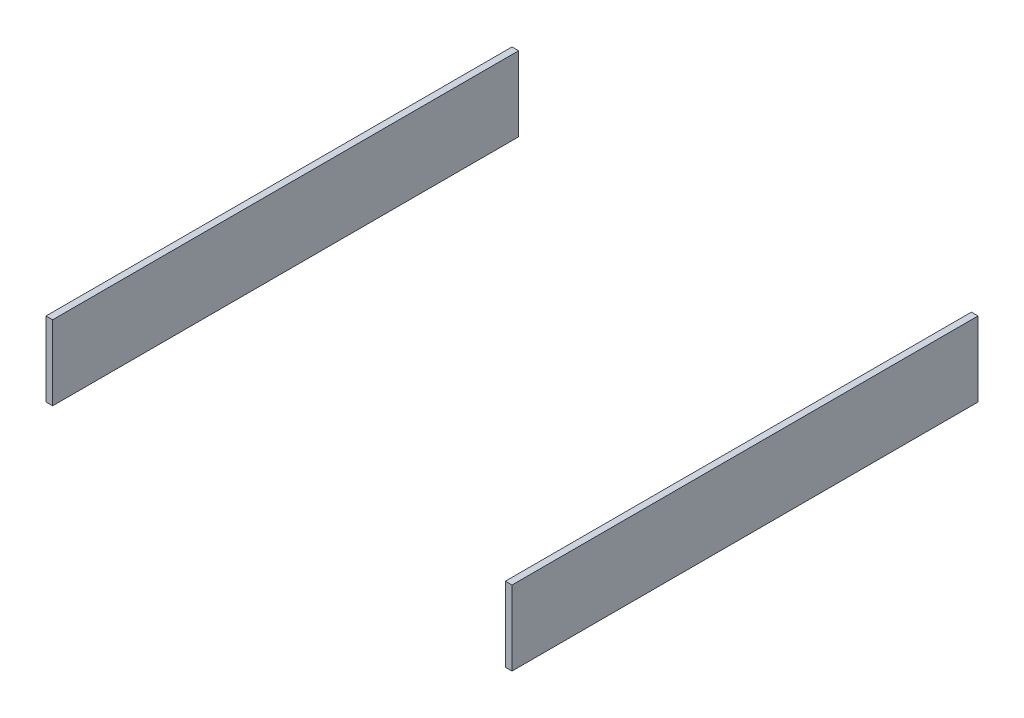
ISO-10303-21;
HEADER;
FILE_DESCRIPTION(('STEP AP214'),'2;1');
FILE_NAME('part.step','',(''),(''),'','','');
FILE_SCHEMA(('AUTOMOTIVE_DESIGN { 1 0 10303 214 1 1 1 1 }'));
ENDSEC;
DATA;
#1=APPLICATION_CONTEXT('core data for automotive mechanical design processes');
#2=APPLICATION_PROTOCOL_DEFINITION('international standard','automotive_design',2000,#1);
#3=PRODUCT_CONTEXT('',#1,'mechanical');
#4=PRODUCT('Part','Part','',(#3));
#5=PRODUCT_RELATED_PRODUCT_CATEGORY('part','',(#4));
#6=PRODUCT_DEFINITION_FORMATION('','',#4);
#7=PRODUCT_DEFINITION_CONTEXT('part definition',#1,'design');
#8=PRODUCT_DEFINITION('design','',#6,#7);
#9=PRODUCT_DEFINITION_SHAPE('','',#8);
#10=(LENGTH_UNIT() NAMED_UNIT(*) SI_UNIT(.MILLI.,.METRE.));
#11=(NAMED_UNIT(*) PLANE_ANGLE_UNIT() SI_UNIT($,.RADIAN.));
#12=(NAMED_UNIT(*) SI_UNIT($,.STERADIAN.) SOLID_ANGLE_UNIT());
#13=UNCERTAINTY_MEASURE_WITH_UNIT(LENGTH_MEASURE(1.E-05),#10,'distance_accuracy_value','');
#14=(GEOMETRIC_REPRESENTATION_CONTEXT(3) GLOBAL_UNCERTAINTY_ASSIGNED_CONTEXT((#13)) GLOBAL_UNIT_ASSIGNED_CONTEXT((#10,
#11,#12)) REPRESENTATION_CONTEXT('',''));
#15=CARTESIAN_POINT('',(0.,0.,0.));
#16=DIRECTION('',(0.,0.,1.));
#17=DIRECTION('',(1.,0.,0.));
#18=AXIS2_PLACEMENT_3D('',#15,#16,#17);
#19=CARTESIAN_POINT('',(125.,41.,-125.));
#20=DIRECTION('',(0.,0.,1.));
#21=DIRECTION('',(1.,0.,0.));
#22=AXIS2_PLACEMENT_3D('',#19,#20,#21);
#23=PLANE('',#22);
#24=DIRECTION('',(-1.,0.,0.));
#25=VECTOR('',#24,1.);
#26=CARTESIAN_POINT('',(125.,1.,-125.));
#27=LINE('',#26,#25);
#28=CARTESIAN_POINT('',(125.,1.,-125.));
#29=VERTEX_POINT('',#28);
#30=CARTESIAN_POINT('',(121.44299646679,1.,-125.));
#31=VERTEX_POINT('',#30);
#32=EDGE_CURVE('E106',#29,#31,#27,.T.);
#33=ORIENTED_EDGE('',*,*,#32,.T.);
#34=DIRECTION('',(0.,-1.,0.));
#35=VECTOR('',#34,1.);
#36=CARTESIAN_POINT('',(121.44299646679,41.,-125.));
#37=LINE('',#36,#35);
#38=CARTESIAN_POINT('',(121.44299646679,41.,-125.));
#39=VERTEX_POINT('',#38);
#40=EDGE_CURVE('E12',#39,#31,#37,.T.);
#41=ORIENTED_EDGE('',*,*,#40,.F.);
#42=DIRECTION('',(-1.,0.,0.));
#43=VECTOR('',#42,1.);
#44=CARTESIAN_POINT('',(125.,41.,-125.));
#45=LINE('',#44,#43);
#46=CARTESIAN_POINT('',(125.,41.,-125.));
#47=VERTEX_POINT('',#46);
#48=EDGE_CURVE('E94',#47,#39,#45,.T.);
#49=ORIENTED_EDGE('',*,*,#48,.F.);
#50=DIRECTION('',(0.,-1.,0.));
#51=VECTOR('',#50,1.);
#52=CARTESIAN_POINT('',(125.,41.,-125.));
#53=LINE('',#52,#51);
#54=EDGE_CURVE('E102',#47,#29,#53,.T.);
#55=ORIENTED_EDGE('',*,*,#54,.T.);
#56=EDGE_LOOP('',(#33,#41,#49,#55));
#57=FACE_BOUND('',#56,.T.);
#58=ADVANCED_FACE('F43',(#57),#23,.F.);
#59=CARTESIAN_POINT('',(121.44299646679,41.,-125.));
#60=DIRECTION('',(1.,0.,0.));
#61=DIRECTION('',(0.,0.,-1.));
#62=AXIS2_PLACEMENT_3D('',#59,#60,#61);
#63=PLANE('',#62);
#64=DIRECTION('',(0.,0.,1.));
#65=VECTOR('',#64,1.);
#66=CARTESIAN_POINT('',(121.44299646679,1.,-125.));
#67=LINE('',#66,#65);
#68=CARTESIAN_POINT('',(121.44299646679,1.,125.));
#69=VERTEX_POINT('',#68);
#70=EDGE_CURVE('E98',#31,#69,#67,.T.);
#71=ORIENTED_EDGE('',*,*,#70,.T.);
#72=DIRECTION('',(0.,-1.,0.));
#73=VECTOR('',#72,1.);
#74=CARTESIAN_POINT('',(121.44299646679,41.,125.));
#75=LINE('',#74,#73);
#76=CARTESIAN_POINT('',(121.44299646679,41.,125.));
#77=VERTEX_POINT('',#76);
#78=EDGE_CURVE('E51',#77,#69,#75,.T.);
#79=ORIENTED_EDGE('',*,*,#78,.F.);
#80=DIRECTION('',(0.,0.,1.));
#81=VECTOR('',#80,1.);
#82=CARTESIAN_POINT('',(121.44299646679,41.,-125.));
#83=LINE('',#82,#81);
#84=EDGE_CURVE('E89',#39,#77,#83,.T.);
#85=ORIENTED_EDGE('',*,*,#84,.F.);
#86=ORIENTED_EDGE('',*,*,#40,.T.);
#87=EDGE_LOOP('',(#71,#79,#85,#86));
#88=FACE_BOUND('',#87,.T.);
#89=ADVANCED_FACE('F97',(#88),#63,.F.);
#90=CARTESIAN_POINT('',(125.,41.,125.));
#91=DIRECTION('',(0.,0.,-1.));
#92=DIRECTION('',(-1.,0.,0.));
#93=AXIS2_PLACEMENT_3D('',#90,#91,#92);
#94=PLANE('',#93);
#95=DIRECTION('',(1.,0.,0.));
#96=VECTOR('',#95,1.);
#97=CARTESIAN_POINT('',(125.,1.,125.));
#98=LINE('',#97,#96);
#99=CARTESIAN_POINT('',(125.,1.,125.));
#100=VERTEX_POINT('',#99);
#101=EDGE_CURVE('E76',#69,#100,#98,.T.);
#102=ORIENTED_EDGE('',*,*,#101,.T.);
#103=DIRECTION('',(0.,-1.,0.));
#104=VECTOR('',#103,1.);
#105=CARTESIAN_POINT('',(125.,41.,125.));
#106=LINE('',#105,#104);
#107=CARTESIAN_POINT('',(125.,41.,125.));
#108=VERTEX_POINT('',#107);
#109=EDGE_CURVE('E99',#108,#100,#106,.T.);
#110=ORIENTED_EDGE('',*,*,#109,.F.);
#111=DIRECTION('',(1.,0.,0.));
#112=VECTOR('',#111,1.);
#113=CARTESIAN_POINT('',(125.,41.,125.));
#114=LINE('',#113,#112);
#115=EDGE_CURVE('E92',#77,#108,#114,.T.);
#116=ORIENTED_EDGE('',*,*,#115,.F.);
#117=ORIENTED_EDGE('',*,*,#78,.T.);
#118=EDGE_LOOP('',(#102,#110,#116,#117));
#119=FACE_BOUND('',#118,.T.);
#120=ADVANCED_FACE('F100',(#119),#94,.F.);
#121=CARTESIAN_POINT('',(125.,41.,-125.));
#122=DIRECTION('',(-1.,0.,0.));
#123=DIRECTION('',(0.,0.,1.));
#124=AXIS2_PLACEMENT_3D('',#121,#122,#123);
#125=PLANE('',#124);
#126=DIRECTION('',(0.,0.,-1.));
#127=VECTOR('',#126,1.);
#128=CARTESIAN_POINT('',(125.,1.,-125.));
#129=LINE('',#128,#127);
#130=EDGE_CURVE('E82',#100,#29,#129,.T.);
#131=ORIENTED_EDGE('',*,*,#130,.T.);
#132=ORIENTED_EDGE('',*,*,#54,.F.);
#133=DIRECTION('',(0.,0.,-1.));
#134=VECTOR('',#133,1.);
#135=CARTESIAN_POINT('',(125.,41.,-125.));
#136=LINE('',#135,#134);
#137=EDGE_CURVE('E59',#108,#47,#136,.T.);
#138=ORIENTED_EDGE('',*,*,#137,.F.);
#139=ORIENTED_EDGE('',*,*,#109,.T.);
#140=EDGE_LOOP('',(#131,#132,#138,#139));
#141=FACE_BOUND('',#140,.T.);
#142=ADVANCED_FACE('F113',(#141),#125,.F.);
#143=CARTESIAN_POINT('',(0.,41.,0.));
#144=DIRECTION('',(0.,1.,0.));
#145=DIRECTION('',(0.,0.,1.));
#146=AXIS2_PLACEMENT_3D('',#143,#144,#145);
#147=PLANE('',#146);
#148=ORIENTED_EDGE('',*,*,#48,.T.);
#149=ORIENTED_EDGE('',*,*,#84,.T.);
#150=ORIENTED_EDGE('',*,*,#115,.T.);
#151=ORIENTED_EDGE('',*,*,#137,.T.);
#152=EDGE_LOOP('',(#148,#149,#150,#151));
#153=FACE_BOUND('',#152,.T.);
#154=ADVANCED_FACE('F90',(#153),#147,.T.);
#155=CARTESIAN_POINT('',(0.,1.,0.));
#156=DIRECTION('',(0.,1.,0.));
#157=DIRECTION('',(0.,0.,1.));
#158=AXIS2_PLACEMENT_3D('',#155,#156,#157);
#159=PLANE('',#158);
#160=ORIENTED_EDGE('',*,*,#32,.F.);
#161=ORIENTED_EDGE('',*,*,#130,.F.);
#162=ORIENTED_EDGE('',*,*,#101,.F.);
#163=ORIENTED_EDGE('',*,*,#70,.F.);
#164=EDGE_LOOP('',(#160,#161,#162,#163));
#165=FACE_BOUND('',#164,.T.);
#166=ADVANCED_FACE('F116',(#165),#159,.F.);
#167=CLOSED_SHELL('',(#58,#89,#120,#142,#154,#166));
#168=MANIFOLD_SOLID_BREP('B2',#167);
#169=CARTESIAN_POINT('',(-125.,41.,-125.));
#170=DIRECTION('',(1.,0.,0.));
#171=DIRECTION('',(0.,0.,-1.));
#172=AXIS2_PLACEMENT_3D('',#169,#170,#171);
#173=PLANE('',#172);
#174=DIRECTION('',(0.,0.,1.));
#175=VECTOR('',#174,1.);
#176=CARTESIAN_POINT('',(-125.,1.,-125.));
#177=LINE('',#176,#175);
#178=CARTESIAN_POINT('',(-125.,1.,-125.));
#179=VERTEX_POINT('',#178);
#180=CARTESIAN_POINT('',(-125.,1.,125.));
#181=VERTEX_POINT('',#180);
#182=EDGE_CURVE('E230',#179,#181,#177,.T.);
#183=ORIENTED_EDGE('',*,*,#182,.T.);
#184=DIRECTION('',(0.,-1.,0.));
#185=VECTOR('',#184,1.);
#186=CARTESIAN_POINT('',(-125.,41.,125.));
#187=LINE('',#186,#185);
#188=CARTESIAN_POINT('',(-125.,41.,125.));
#189=VERTEX_POINT('',#188);
#190=EDGE_CURVE('E41',#189,#181,#187,.T.);
#191=ORIENTED_EDGE('',*,*,#190,.F.);
#192=DIRECTION('',(0.,0.,1.));
#193=VECTOR('',#192,1.);
#194=CARTESIAN_POINT('',(-125.,41.,-125.));
#195=LINE('',#194,#193);
#196=CARTESIAN_POINT('',(-125.,41.,-125.));
#197=VERTEX_POINT('',#196);
#198=EDGE_CURVE('E218',#197,#189,#195,.T.);
#199=ORIENTED_EDGE('',*,*,#198,.F.);
#200=DIRECTION('',(0.,-1.,0.));
#201=VECTOR('',#200,1.);
#202=CARTESIAN_POINT('',(-125.,41.,-125.));
#203=LINE('',#202,#201);
#204=EDGE_CURVE('E226',#197,#179,#203,.T.);
#205=ORIENTED_EDGE('',*,*,#204,.T.);
#206=EDGE_LOOP('',(#183,#191,#199,#205));
#207=FACE_BOUND('',#206,.T.);
#208=ADVANCED_FACE('F167',(#207),#173,.F.);
#209=CARTESIAN_POINT('',(-125.,41.,125.));
#210=DIRECTION('',(0.,0.,-1.));
#211=DIRECTION('',(-1.,0.,0.));
#212=AXIS2_PLACEMENT_3D('',#209,#210,#211);
#213=PLANE('',#212);
#214=DIRECTION('',(1.,0.,0.));
#215=VECTOR('',#214,1.);
#216=CARTESIAN_POINT('',(-125.,1.,125.));
#217=LINE('',#216,#215);
#218=CARTESIAN_POINT('',(-121.44299646679,1.,125.));
#219=VERTEX_POINT('',#218);
#220=EDGE_CURVE('E222',#181,#219,#217,.T.);
#221=ORIENTED_EDGE('',*,*,#220,.T.);
#222=DIRECTION('',(0.,-1.,0.));
#223=VECTOR('',#222,1.);
#224=CARTESIAN_POINT('',(-121.44299646679,41.,125.));
#225=LINE('',#224,#223);
#226=CARTESIAN_POINT('',(-121.44299646679,41.,125.));
#227=VERTEX_POINT('',#226);
#228=EDGE_CURVE('E175',#227,#219,#225,.T.);
#229=ORIENTED_EDGE('',*,*,#228,.F.);
#230=DIRECTION('',(1.,0.,0.));
#231=VECTOR('',#230,1.);
#232=CARTESIAN_POINT('',(-125.,41.,125.));
#233=LINE('',#232,#231);
#234=EDGE_CURVE('E213',#189,#227,#233,.T.);
#235=ORIENTED_EDGE('',*,*,#234,.F.);
#236=ORIENTED_EDGE('',*,*,#190,.T.);
#237=EDGE_LOOP('',(#221,#229,#235,#236));
#238=FACE_BOUND('',#237,.T.);
#239=ADVANCED_FACE('F221',(#238),#213,.F.);
#240=CARTESIAN_POINT('',(-121.44299646679,41.,-125.));
#241=DIRECTION('',(-1.,0.,0.));
#242=DIRECTION('',(0.,0.,1.));
#243=AXIS2_PLACEMENT_3D('',#240,#241,#242);
#244=PLANE('',#243);
#245=DIRECTION('',(0.,0.,-1.));
#246=VECTOR('',#245,1.);
#247=CARTESIAN_POINT('',(-121.44299646679,1.,-125.));
#248=LINE('',#247,#246);
#249=CARTESIAN_POINT('',(-121.44299646679,1.,-125.));
#250=VERTEX_POINT('',#249);
#251=EDGE_CURVE('E200',#219,#250,#248,.T.);
#252=ORIENTED_EDGE('',*,*,#251,.T.);
#253=DIRECTION('',(0.,-1.,0.));
#254=VECTOR('',#253,1.);
#255=CARTESIAN_POINT('',(-121.44299646679,41.,-125.));
#256=LINE('',#255,#254);
#257=CARTESIAN_POINT('',(-121.44299646679,41.,-125.));
#258=VERTEX_POINT('',#257);
#259=EDGE_CURVE('E223',#258,#250,#256,.T.);
#260=ORIENTED_EDGE('',*,*,#259,.F.);
#261=DIRECTION('',(0.,0.,-1.));
#262=VECTOR('',#261,1.);
#263=CARTESIAN_POINT('',(-121.44299646679,41.,-125.));
#264=LINE('',#263,#262);
#265=EDGE_CURVE('E216',#227,#258,#264,.T.);
#266=ORIENTED_EDGE('',*,*,#265,.F.);
#267=ORIENTED_EDGE('',*,*,#228,.T.);
#268=EDGE_LOOP('',(#252,#260,#266,#267));
#269=FACE_BOUND('',#268,.T.);
#270=ADVANCED_FACE('F224',(#269),#244,.F.);
#271=CARTESIAN_POINT('',(-125.,41.,-125.));
#272=DIRECTION('',(0.,0.,1.));
#273=DIRECTION('',(1.,0.,0.));
#274=AXIS2_PLACEMENT_3D('',#271,#272,#273);
#275=PLANE('',#274);
#276=DIRECTION('',(-1.,0.,0.));
#277=VECTOR('',#276,1.);
#278=CARTESIAN_POINT('',(-125.,1.,-125.));
#279=LINE('',#278,#277);
#280=EDGE_CURVE('E206',#250,#179,#279,.T.);
#281=ORIENTED_EDGE('',*,*,#280,.T.);
#282=ORIENTED_EDGE('',*,*,#204,.F.);
#283=DIRECTION('',(-1.,0.,0.));
#284=VECTOR('',#283,1.);
#285=CARTESIAN_POINT('',(-125.,41.,-125.));
#286=LINE('',#285,#284);
#287=EDGE_CURVE('E183',#258,#197,#286,.T.);
#288=ORIENTED_EDGE('',*,*,#287,.F.);
#289=ORIENTED_EDGE('',*,*,#259,.T.);
#290=EDGE_LOOP('',(#281,#282,#288,#289));
#291=FACE_BOUND('',#290,.T.);
#292=ADVANCED_FACE('F237',(#291),#275,.F.);
#293=CARTESIAN_POINT('',(0.,41.,0.));
#294=DIRECTION('',(0.,1.,0.));
#295=DIRECTION('',(0.,0.,1.));
#296=AXIS2_PLACEMENT_3D('',#293,#294,#295);
#297=PLANE('',#296);
#298=ORIENTED_EDGE('',*,*,#198,.T.);
#299=ORIENTED_EDGE('',*,*,#234,.T.);
#300=ORIENTED_EDGE('',*,*,#265,.T.);
#301=ORIENTED_EDGE('',*,*,#287,.T.);
#302=EDGE_LOOP('',(#298,#299,#300,#301));
#303=FACE_BOUND('',#302,.T.);
#304=ADVANCED_FACE('F214',(#303),#297,.T.);
#305=CARTESIAN_POINT('',(0.,1.,0.));
#306=DIRECTION('',(0.,1.,0.));
#307=DIRECTION('',(0.,0.,1.));
#308=AXIS2_PLACEMENT_3D('',#305,#306,#307);
#309=PLANE('',#308);
#310=ORIENTED_EDGE('',*,*,#182,.F.);
#311=ORIENTED_EDGE('',*,*,#280,.F.);
#312=ORIENTED_EDGE('',*,*,#251,.F.);
#313=ORIENTED_EDGE('',*,*,#220,.F.);
#314=EDGE_LOOP('',(#310,#311,#312,#313));
#315=FACE_BOUND('',#314,.T.);
#316=ADVANCED_FACE('F240',(#315),#309,.F.);
#317=CLOSED_SHELL('',(#208,#239,#270,#292,#304,#316));
#318=MANIFOLD_SOLID_BREP('B6',#317);
#319=ADVANCED_BREP_SHAPE_REPRESENTATION('',(#18,#168,#318),#14);
#320=SHAPE_DEFINITION_REPRESENTATION(#9,#319);
ENDSEC;
END-ISO-10303-21;
